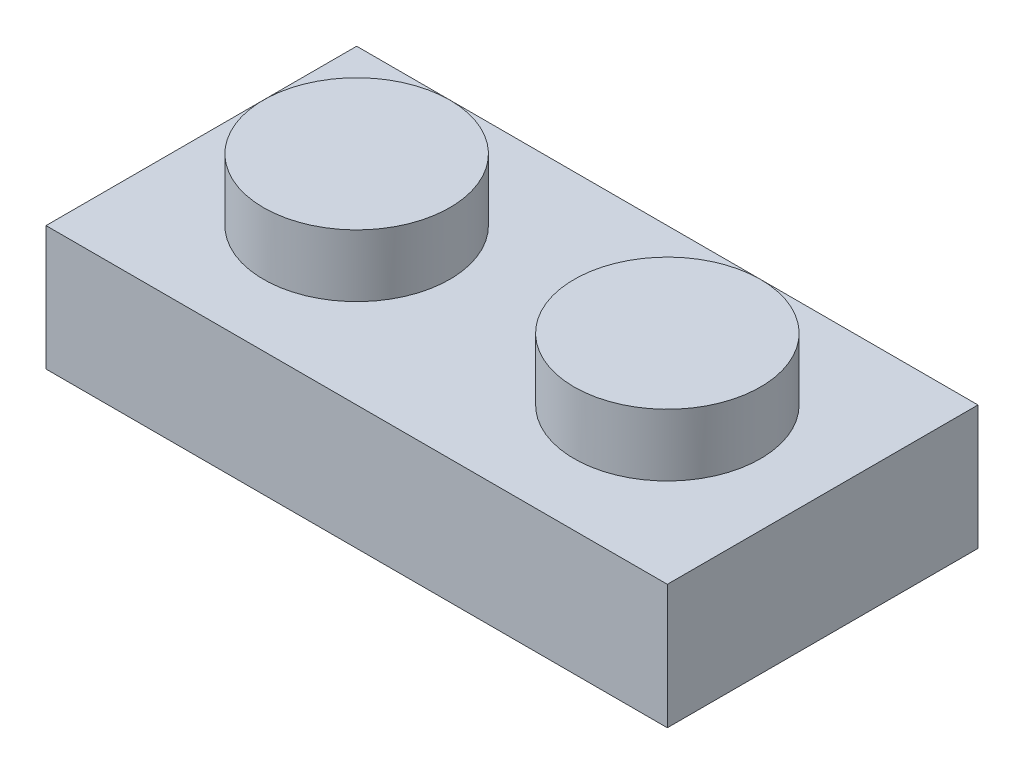
ISO-10303-21;
HEADER;
FILE_DESCRIPTION(('STEP AP214'),'2;1');
FILE_NAME('part.step','',(''),(''),'','','');
FILE_SCHEMA(('AUTOMOTIVE_DESIGN { 1 0 10303 214 1 1 1 1 }'));
ENDSEC;
DATA;
#1=APPLICATION_CONTEXT('core data for automotive mechanical design processes');
#2=APPLICATION_PROTOCOL_DEFINITION('international standard','automotive_design',2000,#1);
#3=PRODUCT_CONTEXT('',#1,'mechanical');
#4=PRODUCT('Part','Part','',(#3));
#5=PRODUCT_RELATED_PRODUCT_CATEGORY('part','',(#4));
#6=PRODUCT_DEFINITION_FORMATION('','',#4);
#7=PRODUCT_DEFINITION_CONTEXT('part definition',#1,'design');
#8=PRODUCT_DEFINITION('design','',#6,#7);
#9=PRODUCT_DEFINITION_SHAPE('','',#8);
#10=(LENGTH_UNIT() NAMED_UNIT(*) SI_UNIT(.MILLI.,.METRE.));
#11=(NAMED_UNIT(*) PLANE_ANGLE_UNIT() SI_UNIT($,.RADIAN.));
#12=(NAMED_UNIT(*) SI_UNIT($,.STERADIAN.) SOLID_ANGLE_UNIT());
#13=UNCERTAINTY_MEASURE_WITH_UNIT(LENGTH_MEASURE(1.E-05),#10,'distance_accuracy_value','');
#14=(GEOMETRIC_REPRESENTATION_CONTEXT(3) GLOBAL_UNCERTAINTY_ASSIGNED_CONTEXT((#13)) GLOBAL_UNIT_ASSIGNED_CONTEXT((#10,
#11,#12)) REPRESENTATION_CONTEXT('',''));
#15=CARTESIAN_POINT('',(0.,0.,0.));
#16=DIRECTION('',(0.,0.,1.));
#17=DIRECTION('',(1.,0.,0.));
#18=AXIS2_PLACEMENT_3D('',#15,#16,#17);
#19=CARTESIAN_POINT('',(-2.5,2.,0.));
#20=DIRECTION('',(0.,-1.,0.));
#21=DIRECTION('',(0.,0.,-1.));
#22=AXIS2_PLACEMENT_3D('',#19,#20,#21);
#23=CYLINDRICAL_SURFACE('',#22,1.5);
#24=CARTESIAN_POINT('',(-2.5,2.,0.));
#25=DIRECTION('',(0.,1.,0.));
#26=DIRECTION('',(0.,0.,1.));
#27=AXIS2_PLACEMENT_3D('',#24,#25,#26);
#28=CIRCLE('',#27,1.5);
#29=CARTESIAN_POINT('',(-2.5,2.,1.5));
#30=VERTEX_POINT('',#29);
#31=EDGE_CURVE('E199',#30,#30,#28,.T.);
#32=ORIENTED_EDGE('',*,*,#31,.F.);
#33=EDGE_LOOP('',(#32));
#34=FACE_BOUND('',#33,.T.);
#35=CARTESIAN_POINT('',(-2.5,1.,0.));
#36=DIRECTION('',(0.,-1.,0.));
#37=DIRECTION('',(0.,0.,-1.));
#38=AXIS2_PLACEMENT_3D('',#35,#36,#37);
#39=CIRCLE('',#38,1.5);
#40=CARTESIAN_POINT('',(-2.5,1.,-1.5));
#41=VERTEX_POINT('',#40);
#42=EDGE_CURVE('E53',#41,#41,#39,.T.);
#43=ORIENTED_EDGE('',*,*,#42,.F.);
#44=EDGE_LOOP('',(#43));
#45=FACE_BOUND('',#44,.T.);
#46=ADVANCED_FACE('F50',(#34,#45),#23,.T.);
#47=CARTESIAN_POINT('',(0.,2.,0.));
#48=DIRECTION('',(0.,1.,0.));
#49=DIRECTION('',(0.,0.,1.));
#50=AXIS2_PLACEMENT_3D('',#47,#48,#49);
#51=PLANE('',#50);
#52=ORIENTED_EDGE('',*,*,#31,.T.);
#53=EDGE_LOOP('',(#52));
#54=FACE_BOUND('',#53,.T.);
#55=ADVANCED_FACE('F214',(#54),#51,.T.);
#56=CARTESIAN_POINT('',(-5.,1.,-2.5));
#57=DIRECTION('',(0.,0.,-1.));
#58=DIRECTION('',(-1.,0.,0.));
#59=AXIS2_PLACEMENT_3D('',#56,#57,#58);
#60=PLANE('',#59);
#61=DIRECTION('',(0.,-1.,0.));
#62=VECTOR('',#61,1.);
#63=CARTESIAN_POINT('',(5.,1.,-2.5));
#64=LINE('',#63,#62);
#65=CARTESIAN_POINT('',(5.,1.,-2.5));
#66=VERTEX_POINT('',#65);
#67=CARTESIAN_POINT('',(5.,-1.,-2.5));
#68=VERTEX_POINT('',#67);
#69=EDGE_CURVE('E196',#66,#68,#64,.T.);
#70=ORIENTED_EDGE('',*,*,#69,.T.);
#71=DIRECTION('',(1.,0.,0.));
#72=VECTOR('',#71,1.);
#73=CARTESIAN_POINT('',(0.,-1.,-2.5));
#74=LINE('',#73,#72);
#75=CARTESIAN_POINT('',(-5.,-1.,-2.5));
#76=VERTEX_POINT('',#75);
#77=EDGE_CURVE('E149',#76,#68,#74,.T.);
#78=ORIENTED_EDGE('',*,*,#77,.F.);
#79=DIRECTION('',(0.,-1.,0.));
#80=VECTOR('',#79,1.);
#81=CARTESIAN_POINT('',(-5.,1.,-2.5));
#82=LINE('',#81,#80);
#83=CARTESIAN_POINT('',(-5.,1.,-2.5));
#84=VERTEX_POINT('',#83);
#85=EDGE_CURVE('E197',#84,#76,#82,.T.);
#86=ORIENTED_EDGE('',*,*,#85,.F.);
#87=DIRECTION('',(1.,0.,0.));
#88=VECTOR('',#87,1.);
#89=CARTESIAN_POINT('',(-5.,1.,-2.5));
#90=LINE('',#89,#88);
#91=EDGE_CURVE('E185',#84,#66,#90,.T.);
#92=ORIENTED_EDGE('',*,*,#91,.T.);
#93=EDGE_LOOP('',(#70,#78,#86,#92));
#94=FACE_BOUND('',#93,.T.);
#95=ADVANCED_FACE('F219',(#94),#60,.T.);
#96=CARTESIAN_POINT('',(-5.,1.,-2.5));
#97=DIRECTION('',(1.,0.,0.));
#98=DIRECTION('',(0.,0.,-1.));
#99=AXIS2_PLACEMENT_3D('',#96,#97,#98);
#100=PLANE('',#99);
#101=ORIENTED_EDGE('',*,*,#85,.T.);
#102=DIRECTION('',(0.,0.,1.));
#103=VECTOR('',#102,1.);
#104=CARTESIAN_POINT('',(-5.,-1.,0.));
#105=LINE('',#104,#103);
#106=CARTESIAN_POINT('',(-5.,-1.,2.5));
#107=VERTEX_POINT('',#106);
#108=EDGE_CURVE('E152',#76,#107,#105,.T.);
#109=ORIENTED_EDGE('',*,*,#108,.T.);
#110=DIRECTION('',(0.,-1.,0.));
#111=VECTOR('',#110,1.);
#112=CARTESIAN_POINT('',(-5.,1.,2.5));
#113=LINE('',#112,#111);
#114=CARTESIAN_POINT('',(-5.,1.,2.5));
#115=VERTEX_POINT('',#114);
#116=EDGE_CURVE('E200',#115,#107,#113,.T.);
#117=ORIENTED_EDGE('',*,*,#116,.F.);
#118=DIRECTION('',(0.,0.,1.));
#119=VECTOR('',#118,1.);
#120=CARTESIAN_POINT('',(-5.,1.,-2.5));
#121=LINE('',#120,#119);
#122=EDGE_CURVE('E194',#84,#115,#121,.T.);
#123=ORIENTED_EDGE('',*,*,#122,.F.);
#124=EDGE_LOOP('',(#101,#109,#117,#123));
#125=FACE_BOUND('',#124,.T.);
#126=ADVANCED_FACE('F225',(#125),#100,.F.);
#127=CARTESIAN_POINT('',(-5.,1.,2.5));
#128=DIRECTION('',(0.,0.,-1.));
#129=DIRECTION('',(-1.,0.,0.));
#130=AXIS2_PLACEMENT_3D('',#127,#128,#129);
#131=PLANE('',#130);
#132=ORIENTED_EDGE('',*,*,#116,.T.);
#133=DIRECTION('',(1.,0.,0.));
#134=VECTOR('',#133,1.);
#135=CARTESIAN_POINT('',(0.,-1.,2.5));
#136=LINE('',#135,#134);
#137=CARTESIAN_POINT('',(5.,-1.,2.5));
#138=VERTEX_POINT('',#137);
#139=EDGE_CURVE('E135',#107,#138,#136,.T.);
#140=ORIENTED_EDGE('',*,*,#139,.T.);
#141=DIRECTION('',(0.,-1.,0.));
#142=VECTOR('',#141,1.);
#143=CARTESIAN_POINT('',(5.,1.,2.5));
#144=LINE('',#143,#142);
#145=CARTESIAN_POINT('',(5.,1.,2.5));
#146=VERTEX_POINT('',#145);
#147=EDGE_CURVE('E202',#146,#138,#144,.T.);
#148=ORIENTED_EDGE('',*,*,#147,.F.);
#149=DIRECTION('',(1.,0.,0.));
#150=VECTOR('',#149,1.);
#151=CARTESIAN_POINT('',(-5.,1.,2.5));
#152=LINE('',#151,#150);
#153=EDGE_CURVE('E192',#115,#146,#152,.T.);
#154=ORIENTED_EDGE('',*,*,#153,.F.);
#155=EDGE_LOOP('',(#132,#140,#148,#154));
#156=FACE_BOUND('',#155,.T.);
#157=ADVANCED_FACE('F293',(#156),#131,.F.);
#158=CARTESIAN_POINT('',(5.,1.,-2.5));
#159=DIRECTION('',(1.,0.,0.));
#160=DIRECTION('',(0.,0.,-1.));
#161=AXIS2_PLACEMENT_3D('',#158,#159,#160);
#162=PLANE('',#161);
#163=ORIENTED_EDGE('',*,*,#147,.T.);
#164=DIRECTION('',(0.,0.,1.));
#165=VECTOR('',#164,1.);
#166=CARTESIAN_POINT('',(5.,-1.,0.));
#167=LINE('',#166,#165);
#168=EDGE_CURVE('E146',#68,#138,#167,.T.);
#169=ORIENTED_EDGE('',*,*,#168,.F.);
#170=ORIENTED_EDGE('',*,*,#69,.F.);
#171=DIRECTION('',(0.,0.,1.));
#172=VECTOR('',#171,1.);
#173=CARTESIAN_POINT('',(5.,1.,-2.5));
#174=LINE('',#173,#172);
#175=EDGE_CURVE('E189',#66,#146,#174,.T.);
#176=ORIENTED_EDGE('',*,*,#175,.T.);
#177=EDGE_LOOP('',(#163,#169,#170,#176));
#178=FACE_BOUND('',#177,.T.);
#179=ADVANCED_FACE('F289',(#178),#162,.T.);
#180=CARTESIAN_POINT('',(0.,1.,0.));
#181=DIRECTION('',(0.,-1.,0.));
#182=DIRECTION('',(0.,0.,-1.));
#183=AXIS2_PLACEMENT_3D('',#180,#181,#182);
#184=PLANE('',#183);
#185=CARTESIAN_POINT('',(2.5,1.,0.));
#186=DIRECTION('',(0.,-1.,0.));
#187=DIRECTION('',(0.,0.,-1.));
#188=AXIS2_PLACEMENT_3D('',#185,#186,#187);
#189=CIRCLE('',#188,1.5);
#190=CARTESIAN_POINT('',(2.5,1.,-1.5));
#191=VERTEX_POINT('',#190);
#192=EDGE_CURVE('E12',#191,#191,#189,.F.);
#193=ORIENTED_EDGE('',*,*,#192,.F.);
#194=EDGE_LOOP('',(#193));
#195=FACE_BOUND('',#194,.T.);
#196=ORIENTED_EDGE('',*,*,#42,.T.);
#197=EDGE_LOOP('',(#196));
#198=FACE_BOUND('',#197,.T.);
#199=ORIENTED_EDGE('',*,*,#91,.F.);
#200=ORIENTED_EDGE('',*,*,#122,.T.);
#201=ORIENTED_EDGE('',*,*,#153,.T.);
#202=ORIENTED_EDGE('',*,*,#175,.F.);
#203=EDGE_LOOP('',(#199,#200,#201,#202));
#204=FACE_BOUND('',#203,.T.);
#205=ADVANCED_FACE('F210',(#195,#198,#204),#184,.F.);
#206=CARTESIAN_POINT('',(2.5,2.,0.));
#207=DIRECTION('',(0.,-1.,0.));
#208=DIRECTION('',(0.,0.,-1.));
#209=AXIS2_PLACEMENT_3D('',#206,#207,#208);
#210=CYLINDRICAL_SURFACE('',#209,1.5);
#211=CARTESIAN_POINT('',(2.5,2.,0.));
#212=DIRECTION('',(0.,1.,0.));
#213=DIRECTION('',(0.,0.,1.));
#214=AXIS2_PLACEMENT_3D('',#211,#212,#213);
#215=CIRCLE('',#214,1.5);
#216=CARTESIAN_POINT('',(2.5,2.,1.5));
#217=VERTEX_POINT('',#216);
#218=EDGE_CURVE('E181',#217,#217,#215,.T.);
#219=ORIENTED_EDGE('',*,*,#218,.F.);
#220=EDGE_LOOP('',(#219));
#221=FACE_BOUND('',#220,.T.);
#222=ORIENTED_EDGE('',*,*,#192,.T.);
#223=EDGE_LOOP('',(#222));
#224=FACE_BOUND('',#223,.T.);
#225=ADVANCED_FACE('F283',(#221,#224),#210,.T.);
#226=CARTESIAN_POINT('',(0.,2.,0.));
#227=DIRECTION('',(0.,1.,0.));
#228=DIRECTION('',(0.,0.,1.));
#229=AXIS2_PLACEMENT_3D('',#226,#227,#228);
#230=PLANE('',#229);
#231=ORIENTED_EDGE('',*,*,#218,.T.);
#232=EDGE_LOOP('',(#231));
#233=FACE_BOUND('',#232,.T.);
#234=ADVANCED_FACE('F256',(#233),#230,.T.);
#235=CARTESIAN_POINT('',(4.,-1.,0.));
#236=DIRECTION('',(1.,0.,0.));
#237=DIRECTION('',(0.,0.,-1.));
#238=AXIS2_PLACEMENT_3D('',#235,#236,#237);
#239=PLANE('',#238);
#240=DIRECTION('',(0.,0.,-1.));
#241=VECTOR('',#240,1.);
#242=CARTESIAN_POINT('',(4.,0.,0.));
#243=LINE('',#242,#241);
#244=CARTESIAN_POINT('',(4.,0.,1.5));
#245=VERTEX_POINT('',#244);
#246=CARTESIAN_POINT('',(4.,0.,-1.5));
#247=VERTEX_POINT('',#246);
#248=EDGE_CURVE('E157',#245,#247,#243,.T.);
#249=ORIENTED_EDGE('',*,*,#248,.T.);
#250=DIRECTION('',(0.,1.,0.));
#251=VECTOR('',#250,1.);
#252=CARTESIAN_POINT('',(4.,-1.,-1.5));
#253=LINE('',#252,#251);
#254=CARTESIAN_POINT('',(4.,-1.,-1.5));
#255=VERTEX_POINT('',#254);
#256=EDGE_CURVE('E138',#255,#247,#253,.T.);
#257=ORIENTED_EDGE('',*,*,#256,.F.);
#258=DIRECTION('',(0.,0.,-1.));
#259=VECTOR('',#258,1.);
#260=CARTESIAN_POINT('',(4.,-1.,0.));
#261=LINE('',#260,#259);
#262=CARTESIAN_POINT('',(4.,-1.,1.5));
#263=VERTEX_POINT('',#262);
#264=EDGE_CURVE('E120',#263,#255,#261,.T.);
#265=ORIENTED_EDGE('',*,*,#264,.F.);
#266=DIRECTION('',(0.,1.,0.));
#267=VECTOR('',#266,1.);
#268=CARTESIAN_POINT('',(4.,-1.,1.5));
#269=LINE('',#268,#267);
#270=EDGE_CURVE('E129',#263,#245,#269,.T.);
#271=ORIENTED_EDGE('',*,*,#270,.T.);
#272=EDGE_LOOP('',(#249,#257,#265,#271));
#273=FACE_BOUND('',#272,.T.);
#274=ADVANCED_FACE('F137',(#273),#239,.F.);
#275=CARTESIAN_POINT('',(0.,-1.,-1.5));
#276=DIRECTION('',(0.,0.,1.));
#277=DIRECTION('',(1.,0.,0.));
#278=AXIS2_PLACEMENT_3D('',#275,#276,#277);
#279=PLANE('',#278);
#280=DIRECTION('',(1.,0.,0.));
#281=VECTOR('',#280,1.);
#282=CARTESIAN_POINT('',(0.,0.,-1.5));
#283=LINE('',#282,#281);
#284=CARTESIAN_POINT('',(-4.,0.,-1.5));
#285=VERTEX_POINT('',#284);
#286=EDGE_CURVE('E65',#285,#247,#283,.T.);
#287=ORIENTED_EDGE('',*,*,#286,.F.);
#288=DIRECTION('',(0.,1.,0.));
#289=VECTOR('',#288,1.);
#290=CARTESIAN_POINT('',(-4.,-1.,-1.5));
#291=LINE('',#290,#289);
#292=CARTESIAN_POINT('',(-4.,-1.,-1.5));
#293=VERTEX_POINT('',#292);
#294=EDGE_CURVE('E163',#293,#285,#291,.T.);
#295=ORIENTED_EDGE('',*,*,#294,.F.);
#296=DIRECTION('',(1.,0.,0.));
#297=VECTOR('',#296,1.);
#298=CARTESIAN_POINT('',(0.,-1.,-1.5));
#299=LINE('',#298,#297);
#300=EDGE_CURVE('E144',#293,#255,#299,.T.);
#301=ORIENTED_EDGE('',*,*,#300,.T.);
#302=ORIENTED_EDGE('',*,*,#256,.T.);
#303=EDGE_LOOP('',(#287,#295,#301,#302));
#304=FACE_BOUND('',#303,.T.);
#305=ADVANCED_FACE('F248',(#304),#279,.T.);
#306=CARTESIAN_POINT('',(-4.,-1.,0.));
#307=DIRECTION('',(1.,0.,0.));
#308=DIRECTION('',(0.,0.,-1.));
#309=AXIS2_PLACEMENT_3D('',#306,#307,#308);
#310=PLANE('',#309);
#311=DIRECTION('',(0.,0.,-1.));
#312=VECTOR('',#311,1.);
#313=CARTESIAN_POINT('',(-4.,0.,0.));
#314=LINE('',#313,#312);
#315=CARTESIAN_POINT('',(-4.,0.,1.5));
#316=VERTEX_POINT('',#315);
#317=EDGE_CURVE('E70',#316,#285,#314,.T.);
#318=ORIENTED_EDGE('',*,*,#317,.F.);
#319=DIRECTION('',(0.,1.,0.));
#320=VECTOR('',#319,1.);
#321=CARTESIAN_POINT('',(-4.,-1.,1.5));
#322=LINE('',#321,#320);
#323=CARTESIAN_POINT('',(-4.,-1.,1.5));
#324=VERTEX_POINT('',#323);
#325=EDGE_CURVE('E134',#324,#316,#322,.T.);
#326=ORIENTED_EDGE('',*,*,#325,.F.);
#327=DIRECTION('',(0.,0.,-1.));
#328=VECTOR('',#327,1.);
#329=CARTESIAN_POINT('',(-4.,-1.,0.));
#330=LINE('',#329,#328);
#331=EDGE_CURVE('E123',#324,#293,#330,.T.);
#332=ORIENTED_EDGE('',*,*,#331,.T.);
#333=ORIENTED_EDGE('',*,*,#294,.T.);
#334=EDGE_LOOP('',(#318,#326,#332,#333));
#335=FACE_BOUND('',#334,.T.);
#336=ADVANCED_FACE('F246',(#335),#310,.T.);
#337=CARTESIAN_POINT('',(0.,-1.,1.5));
#338=DIRECTION('',(0.,0.,1.));
#339=DIRECTION('',(1.,0.,0.));
#340=AXIS2_PLACEMENT_3D('',#337,#338,#339);
#341=PLANE('',#340);
#342=DIRECTION('',(1.,0.,0.));
#343=VECTOR('',#342,1.);
#344=CARTESIAN_POINT('',(0.,0.,1.5));
#345=LINE('',#344,#343);
#346=EDGE_CURVE('E131',#316,#245,#345,.T.);
#347=ORIENTED_EDGE('',*,*,#346,.T.);
#348=ORIENTED_EDGE('',*,*,#270,.F.);
#349=DIRECTION('',(1.,0.,0.));
#350=VECTOR('',#349,1.);
#351=CARTESIAN_POINT('',(0.,-1.,1.5));
#352=LINE('',#351,#350);
#353=EDGE_CURVE('E114',#324,#263,#352,.T.);
#354=ORIENTED_EDGE('',*,*,#353,.F.);
#355=ORIENTED_EDGE('',*,*,#325,.T.);
#356=EDGE_LOOP('',(#347,#348,#354,#355));
#357=FACE_BOUND('',#356,.T.);
#358=ADVANCED_FACE('F130',(#357),#341,.F.);
#359=CARTESIAN_POINT('',(0.,-1.,0.));
#360=DIRECTION('',(0.,1.,0.));
#361=DIRECTION('',(0.,0.,1.));
#362=AXIS2_PLACEMENT_3D('',#359,#360,#361);
#363=PLANE('',#362);
#364=ORIENTED_EDGE('',*,*,#264,.T.);
#365=ORIENTED_EDGE('',*,*,#300,.F.);
#366=ORIENTED_EDGE('',*,*,#331,.F.);
#367=ORIENTED_EDGE('',*,*,#353,.T.);
#368=EDGE_LOOP('',(#364,#365,#366,#367));
#369=FACE_BOUND('',#368,.T.);
#370=ORIENTED_EDGE('',*,*,#168,.T.);
#371=ORIENTED_EDGE('',*,*,#139,.F.);
#372=ORIENTED_EDGE('',*,*,#108,.F.);
#373=ORIENTED_EDGE('',*,*,#77,.T.);
#374=EDGE_LOOP('',(#370,#371,#372,#373));
#375=FACE_BOUND('',#374,.T.);
#376=ADVANCED_FACE('F116',(#369,#375),#363,.F.);
#377=CARTESIAN_POINT('',(0.,-1.,0.));
#378=DIRECTION('',(0.,1.,0.));
#379=DIRECTION('',(0.,0.,1.));
#380=AXIS2_PLACEMENT_3D('',#377,#378,#379);
#381=PLANE('',#380);
#382=CARTESIAN_POINT('',(0.,-1.,0.));
#383=DIRECTION('',(0.,1.,0.));
#384=DIRECTION('',(0.,0.,1.));
#385=AXIS2_PLACEMENT_3D('',#382,#383,#384);
#386=CIRCLE('',#385,0.999999999999998);
#387=CARTESIAN_POINT('',(0.,-1.,0.999999999999999));
#388=VERTEX_POINT('',#387);
#389=EDGE_CURVE('E166',#388,#388,#386,.T.);
#390=ORIENTED_EDGE('',*,*,#389,.F.);
#391=EDGE_LOOP('',(#390));
#392=FACE_BOUND('',#391,.T.);
#393=ADVANCED_FACE('F262',(#392),#381,.F.);
#394=CARTESIAN_POINT('',(0.,1.,0.));
#395=DIRECTION('',(0.,1.,0.));
#396=DIRECTION('',(0.,0.,1.));
#397=AXIS2_PLACEMENT_3D('',#394,#395,#396);
#398=PLANE('',#397);
#399=CARTESIAN_POINT('',(2.5,1.,0.));
#400=DIRECTION('',(0.,1.,0.));
#401=DIRECTION('',(0.,0.,1.));
#402=AXIS2_PLACEMENT_3D('',#399,#400,#401);
#403=CIRCLE('',#402,0.75);
#404=CARTESIAN_POINT('',(2.5,1.,0.750000000000001));
#405=VERTEX_POINT('',#404);
#406=EDGE_CURVE('E172',#405,#405,#403,.T.);
#407=ORIENTED_EDGE('',*,*,#406,.F.);
#408=EDGE_LOOP('',(#407));
#409=FACE_BOUND('',#408,.T.);
#410=ADVANCED_FACE('F265',(#409),#398,.F.);
#411=CARTESIAN_POINT('',(0.,1.,0.));
#412=DIRECTION('',(0.,1.,0.));
#413=DIRECTION('',(0.,0.,1.));
#414=AXIS2_PLACEMENT_3D('',#411,#412,#413);
#415=PLANE('',#414);
#416=CARTESIAN_POINT('',(-2.5,1.,0.));
#417=DIRECTION('',(0.,1.,0.));
#418=DIRECTION('',(0.,0.,1.));
#419=AXIS2_PLACEMENT_3D('',#416,#417,#418);
#420=CIRCLE('',#419,0.75);
#421=CARTESIAN_POINT('',(-2.5,1.,0.75));
#422=VERTEX_POINT('',#421);
#423=EDGE_CURVE('E178',#422,#422,#420,.T.);
#424=ORIENTED_EDGE('',*,*,#423,.F.);
#425=EDGE_LOOP('',(#424));
#426=FACE_BOUND('',#425,.T.);
#427=ADVANCED_FACE('F270',(#426),#415,.F.);
#428=CARTESIAN_POINT('',(0.,-1.,0.));
#429=DIRECTION('',(0.,1.,0.));
#430=DIRECTION('',(0.,0.,1.));
#431=AXIS2_PLACEMENT_3D('',#428,#429,#430);
#432=CYLINDRICAL_SURFACE('',#431,0.999999999999998);
#433=ORIENTED_EDGE('',*,*,#389,.T.);
#434=EDGE_LOOP('',(#433));
#435=FACE_BOUND('',#434,.T.);
#436=CARTESIAN_POINT('',(0.,0.,0.));
#437=DIRECTION('',(0.,1.,0.));
#438=DIRECTION('',(0.,0.,1.));
#439=AXIS2_PLACEMENT_3D('',#436,#437,#438);
#440=CIRCLE('',#439,0.999999999999998);
#441=CARTESIAN_POINT('',(0.,0.,0.999999999999999));
#442=VERTEX_POINT('',#441);
#443=EDGE_CURVE('E162',#442,#442,#440,.T.);
#444=ORIENTED_EDGE('',*,*,#443,.F.);
#445=EDGE_LOOP('',(#444));
#446=FACE_BOUND('',#445,.T.);
#447=ADVANCED_FACE('F267',(#435,#446),#432,.T.);
#448=CARTESIAN_POINT('',(2.5,1.,0.));
#449=DIRECTION('',(0.,-1.,0.));
#450=DIRECTION('',(0.,0.,-1.));
#451=AXIS2_PLACEMENT_3D('',#448,#449,#450);
#452=CYLINDRICAL_SURFACE('',#451,0.75);
#453=ORIENTED_EDGE('',*,*,#406,.T.);
#454=EDGE_LOOP('',(#453));
#455=FACE_BOUND('',#454,.T.);
#456=CARTESIAN_POINT('',(2.5,0.,0.));
#457=DIRECTION('',(0.,1.,0.));
#458=DIRECTION('',(0.,0.,1.));
#459=AXIS2_PLACEMENT_3D('',#456,#457,#458);
#460=CIRCLE('',#459,0.75);
#461=CARTESIAN_POINT('',(2.5,0.,0.750000000000001));
#462=VERTEX_POINT('',#461);
#463=EDGE_CURVE('E169',#462,#462,#460,.T.);
#464=ORIENTED_EDGE('',*,*,#463,.F.);
#465=EDGE_LOOP('',(#464));
#466=FACE_BOUND('',#465,.T.);
#467=ADVANCED_FACE('F237',(#455,#466),#452,.F.);
#468=CARTESIAN_POINT('',(-2.5,1.,0.));
#469=DIRECTION('',(0.,-1.,0.));
#470=DIRECTION('',(0.,0.,-1.));
#471=AXIS2_PLACEMENT_3D('',#468,#469,#470);
#472=CYLINDRICAL_SURFACE('',#471,0.75);
#473=ORIENTED_EDGE('',*,*,#423,.T.);
#474=EDGE_LOOP('',(#473));
#475=FACE_BOUND('',#474,.T.);
#476=CARTESIAN_POINT('',(-2.5,0.,0.));
#477=DIRECTION('',(0.,1.,0.));
#478=DIRECTION('',(0.,0.,1.));
#479=AXIS2_PLACEMENT_3D('',#476,#477,#478);
#480=CIRCLE('',#479,0.75);
#481=CARTESIAN_POINT('',(-2.5,0.,0.75));
#482=VERTEX_POINT('',#481);
#483=EDGE_CURVE('E175',#482,#482,#480,.T.);
#484=ORIENTED_EDGE('',*,*,#483,.F.);
#485=EDGE_LOOP('',(#484));
#486=FACE_BOUND('',#485,.T.);
#487=ADVANCED_FACE('F231',(#475,#486),#472,.F.);
#488=CARTESIAN_POINT('',(0.,0.,0.));
#489=DIRECTION('',(0.,1.,0.));
#490=DIRECTION('',(0.,0.,1.));
#491=AXIS2_PLACEMENT_3D('',#488,#489,#490);
#492=PLANE('',#491);
#493=ORIENTED_EDGE('',*,*,#483,.T.);
#494=EDGE_LOOP('',(#493));
#495=FACE_BOUND('',#494,.T.);
#496=ORIENTED_EDGE('',*,*,#463,.T.);
#497=EDGE_LOOP('',(#496));
#498=FACE_BOUND('',#497,.T.);
#499=ORIENTED_EDGE('',*,*,#443,.T.);
#500=EDGE_LOOP('',(#499));
#501=FACE_BOUND('',#500,.T.);
#502=ORIENTED_EDGE('',*,*,#248,.F.);
#503=ORIENTED_EDGE('',*,*,#346,.F.);
#504=ORIENTED_EDGE('',*,*,#317,.T.);
#505=ORIENTED_EDGE('',*,*,#286,.T.);
#506=EDGE_LOOP('',(#502,#503,#504,#505));
#507=FACE_BOUND('',#506,.T.);
#508=ADVANCED_FACE('F229',(#495,#498,#501,#507),#492,.F.);
#509=CLOSED_SHELL('',(#46,#55,#95,#126,#157,#179,#205,#225,#234,#274,#305,#336,#358,#376,#393,
#410,#427,#447,#467,#487,#508));
#510=MANIFOLD_SOLID_BREP('B2',#509);
#511=ADVANCED_BREP_SHAPE_REPRESENTATION('',(#18,#510),#14);
#512=SHAPE_DEFINITION_REPRESENTATION(#9,#511);
ENDSEC;
END-ISO-10303-21;
